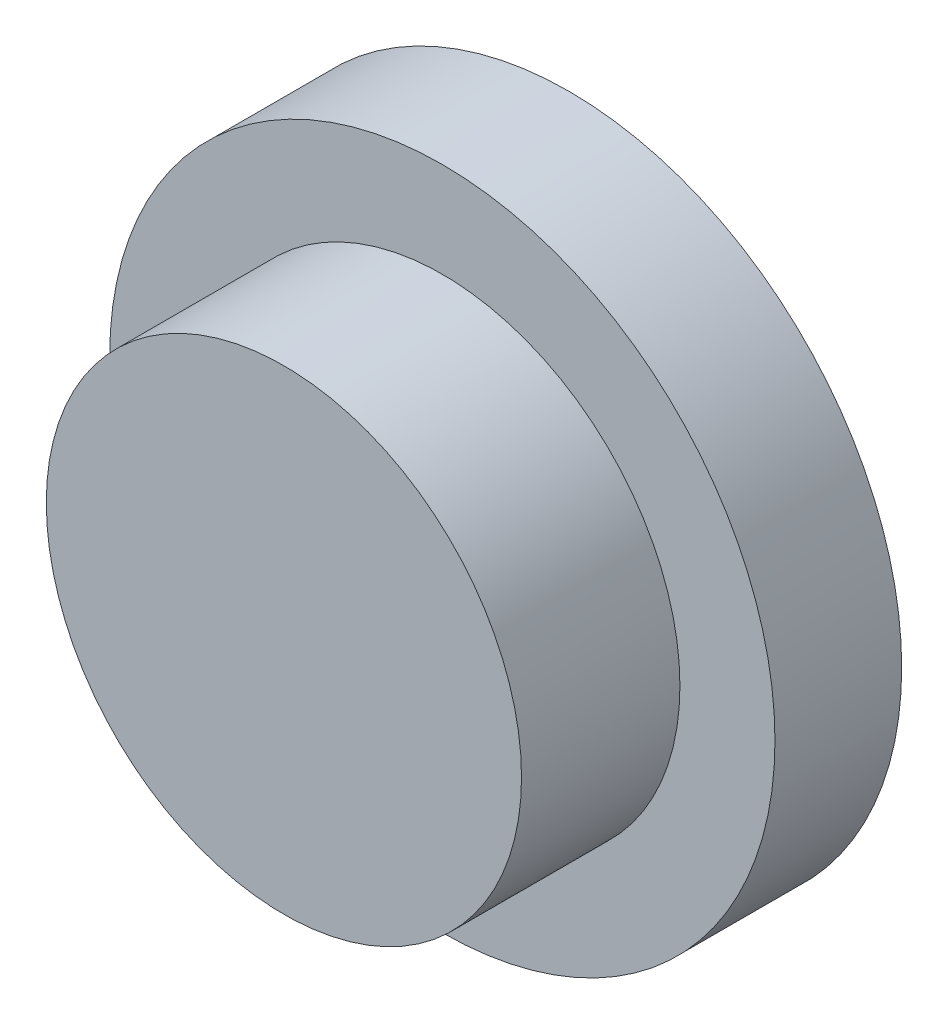
ISO-10303-21;
HEADER;
FILE_DESCRIPTION(('STEP AP214'),'2;1');
FILE_NAME('part.step','',(''),(''),'','','');
FILE_SCHEMA(('AUTOMOTIVE_DESIGN { 1 0 10303 214 1 1 1 1 }'));
ENDSEC;
DATA;
#1=APPLICATION_CONTEXT('core data for automotive mechanical design processes');
#2=APPLICATION_PROTOCOL_DEFINITION('international standard','automotive_design',2000,#1);
#3=PRODUCT_CONTEXT('',#1,'mechanical');
#4=PRODUCT('Part','Part','',(#3));
#5=PRODUCT_RELATED_PRODUCT_CATEGORY('part','',(#4));
#6=PRODUCT_DEFINITION_FORMATION('','',#4);
#7=PRODUCT_DEFINITION_CONTEXT('part definition',#1,'design');
#8=PRODUCT_DEFINITION('design','',#6,#7);
#9=PRODUCT_DEFINITION_SHAPE('','',#8);
#10=(LENGTH_UNIT() NAMED_UNIT(*) SI_UNIT(.MILLI.,.METRE.));
#11=(NAMED_UNIT(*) PLANE_ANGLE_UNIT() SI_UNIT($,.RADIAN.));
#12=(NAMED_UNIT(*) SI_UNIT($,.STERADIAN.) SOLID_ANGLE_UNIT());
#13=UNCERTAINTY_MEASURE_WITH_UNIT(LENGTH_MEASURE(1.E-05),#10,'distance_accuracy_value','');
#14=(GEOMETRIC_REPRESENTATION_CONTEXT(3) GLOBAL_UNCERTAINTY_ASSIGNED_CONTEXT((#13)) GLOBAL_UNIT_ASSIGNED_CONTEXT((#10,
#11,#12)) REPRESENTATION_CONTEXT('',''));
#15=CARTESIAN_POINT('',(0.,0.,0.));
#16=DIRECTION('',(0.,0.,1.));
#17=DIRECTION('',(1.,0.,0.));
#18=AXIS2_PLACEMENT_3D('',#15,#16,#17);
#19=CARTESIAN_POINT('',(0.,0.,5.));
#20=DIRECTION('',(0.,0.,-1.));
#21=DIRECTION('',(-1.,0.,0.));
#22=AXIS2_PLACEMENT_3D('',#19,#20,#21);
#23=CYLINDRICAL_SURFACE('',#22,7.5);
#24=CARTESIAN_POINT('',(0.,0.,5.));
#25=DIRECTION('',(0.,0.,1.));
#26=DIRECTION('',(1.,0.,0.));
#27=AXIS2_PLACEMENT_3D('',#24,#25,#26);
#28=CIRCLE('',#27,7.5);
#29=CARTESIAN_POINT('',(7.5,0.,5.));
#30=VERTEX_POINT('',#29);
#31=EDGE_CURVE('E53',#30,#30,#28,.T.);
#32=ORIENTED_EDGE('',*,*,#31,.F.);
#33=EDGE_LOOP('',(#32));
#34=FACE_BOUND('',#33,.T.);
#35=CARTESIAN_POINT('',(0.,0.,0.));
#36=DIRECTION('',(0.,0.,1.));
#37=DIRECTION('',(1.,0.,0.));
#38=AXIS2_PLACEMENT_3D('',#35,#36,#37);
#39=CIRCLE('',#38,7.5);
#40=CARTESIAN_POINT('',(7.5,0.,0.));
#41=VERTEX_POINT('',#40);
#42=EDGE_CURVE('E58',#41,#41,#39,.T.);
#43=ORIENTED_EDGE('',*,*,#42,.T.);
#44=EDGE_LOOP('',(#43));
#45=FACE_BOUND('',#44,.T.);
#46=ADVANCED_FACE('F39',(#34,#45),#23,.T.);
#47=CARTESIAN_POINT('',(0.,0.,5.));
#48=DIRECTION('',(0.,0.,1.));
#49=DIRECTION('',(1.,0.,0.));
#50=AXIS2_PLACEMENT_3D('',#47,#48,#49);
#51=PLANE('',#50);
#52=ORIENTED_EDGE('',*,*,#31,.T.);
#53=EDGE_LOOP('',(#52));
#54=FACE_BOUND('',#53,.T.);
#55=ADVANCED_FACE('F93',(#54),#51,.T.);
#56=CARTESIAN_POINT('',(0.,0.,-4.));
#57=DIRECTION('',(0.,0.,1.));
#58=DIRECTION('',(1.,0.,0.));
#59=AXIS2_PLACEMENT_3D('',#56,#57,#58);
#60=CYLINDRICAL_SURFACE('',#59,10.5);
#61=CARTESIAN_POINT('',(0.,0.,-4.));
#62=DIRECTION('',(0.,0.,-1.));
#63=DIRECTION('',(-1.,0.,0.));
#64=AXIS2_PLACEMENT_3D('',#61,#62,#63);
#65=CIRCLE('',#64,10.5);
#66=CARTESIAN_POINT('',(-10.5,0.,-4.));
#67=VERTEX_POINT('',#66);
#68=EDGE_CURVE('E63',#67,#67,#65,.T.);
#69=ORIENTED_EDGE('',*,*,#68,.F.);
#70=EDGE_LOOP('',(#69));
#71=FACE_BOUND('',#70,.T.);
#72=CARTESIAN_POINT('',(0.,0.,0.));
#73=DIRECTION('',(0.,0.,-1.));
#74=DIRECTION('',(-1.,0.,0.));
#75=AXIS2_PLACEMENT_3D('',#72,#73,#74);
#76=CIRCLE('',#75,10.5);
#77=CARTESIAN_POINT('',(-10.5,0.,0.));
#78=VERTEX_POINT('',#77);
#79=EDGE_CURVE('E65',#78,#78,#76,.T.);
#80=ORIENTED_EDGE('',*,*,#79,.T.);
#81=EDGE_LOOP('',(#80));
#82=FACE_BOUND('',#81,.T.);
#83=ADVANCED_FACE('F98',(#71,#82),#60,.T.);
#84=CARTESIAN_POINT('',(0.,0.,-4.));
#85=DIRECTION('',(0.,0.,-1.));
#86=DIRECTION('',(-1.,0.,0.));
#87=AXIS2_PLACEMENT_3D('',#84,#85,#86);
#88=PLANE('',#87);
#89=CARTESIAN_POINT('',(0.,0.,-4.));
#90=DIRECTION('',(0.,0.,-1.));
#91=DIRECTION('',(-1.,0.,0.));
#92=AXIS2_PLACEMENT_3D('',#89,#90,#91);
#93=CIRCLE('',#92,8.75);
#94=CARTESIAN_POINT('',(-8.75,0.,-4.));
#95=VERTEX_POINT('',#94);
#96=EDGE_CURVE('E10',#95,#95,#93,.F.);
#97=ORIENTED_EDGE('',*,*,#96,.T.);
#98=EDGE_LOOP('',(#97));
#99=FACE_BOUND('',#98,.T.);
#100=ORIENTED_EDGE('',*,*,#68,.T.);
#101=EDGE_LOOP('',(#100));
#102=FACE_BOUND('',#101,.T.);
#103=ADVANCED_FACE('F88',(#99,#102),#88,.T.);
#104=CARTESIAN_POINT('',(0.,0.,0.));
#105=DIRECTION('',(0.,0.,-1.));
#106=DIRECTION('',(-1.,0.,0.));
#107=AXIS2_PLACEMENT_3D('',#104,#105,#106);
#108=PLANE('',#107);
#109=ORIENTED_EDGE('',*,*,#42,.F.);
#110=EDGE_LOOP('',(#109));
#111=FACE_BOUND('',#110,.T.);
#112=ORIENTED_EDGE('',*,*,#79,.F.);
#113=EDGE_LOOP('',(#112));
#114=FACE_BOUND('',#113,.T.);
#115=ADVANCED_FACE('F81',(#111,#114),#108,.F.);
#116=CARTESIAN_POINT('',(0.,0.,-1.));
#117=DIRECTION('',(0.,0.,-1.));
#118=DIRECTION('',(-1.,0.,0.));
#119=AXIS2_PLACEMENT_3D('',#116,#117,#118);
#120=CYLINDRICAL_SURFACE('',#119,8.25);
#121=CARTESIAN_POINT('',(0.,0.,-3.5));
#122=DIRECTION('',(0.,0.,-1.));
#123=DIRECTION('',(-1.,0.,0.));
#124=AXIS2_PLACEMENT_3D('',#121,#122,#123);
#125=CIRCLE('',#124,8.25);
#126=CARTESIAN_POINT('',(-8.25,0.,-3.5));
#127=VERTEX_POINT('',#126);
#128=EDGE_CURVE('E48',#127,#127,#125,.T.);
#129=ORIENTED_EDGE('',*,*,#128,.T.);
#130=EDGE_LOOP('',(#129));
#131=FACE_BOUND('',#130,.T.);
#132=CARTESIAN_POINT('',(0.,0.,-1.));
#133=DIRECTION('',(0.,0.,-1.));
#134=DIRECTION('',(-1.,0.,0.));
#135=AXIS2_PLACEMENT_3D('',#132,#133,#134);
#136=CIRCLE('',#135,8.25);
#137=CARTESIAN_POINT('',(-8.25,0.,-1.));
#138=VERTEX_POINT('',#137);
#139=EDGE_CURVE('E69',#138,#138,#136,.T.);
#140=ORIENTED_EDGE('',*,*,#139,.F.);
#141=EDGE_LOOP('',(#140));
#142=FACE_BOUND('',#141,.T.);
#143=ADVANCED_FACE('F79',(#131,#142),#120,.F.);
#144=CARTESIAN_POINT('',(0.,0.,-1.));
#145=DIRECTION('',(0.,0.,-1.));
#146=DIRECTION('',(-1.,0.,0.));
#147=AXIS2_PLACEMENT_3D('',#144,#145,#146);
#148=PLANE('',#147);
#149=ORIENTED_EDGE('',*,*,#139,.T.);
#150=EDGE_LOOP('',(#149));
#151=FACE_BOUND('',#150,.T.);
#152=ADVANCED_FACE('F77',(#151),#148,.T.);
#153=CARTESIAN_POINT('',(0.,0.,-3.5));
#154=DIRECTION('',(0.,0.,-1.));
#155=DIRECTION('',(-1.,0.,0.));
#156=AXIS2_PLACEMENT_3D('',#153,#154,#155);
#157=CONICAL_SURFACE('',#156,8.25,0.785398163397452);
#158=ORIENTED_EDGE('',*,*,#96,.F.);
#159=EDGE_LOOP('',(#158));
#160=FACE_BOUND('',#159,.T.);
#161=ORIENTED_EDGE('',*,*,#128,.F.);
#162=EDGE_LOOP('',(#161));
#163=FACE_BOUND('',#162,.T.);
#164=ADVANCED_FACE('F42',(#160,#163),#157,.F.);
#165=CLOSED_SHELL('',(#46,#55,#83,#103,#115,#143,#152,#164));
#166=MANIFOLD_SOLID_BREP('B2',#165);
#167=ADVANCED_BREP_SHAPE_REPRESENTATION('',(#18,#166),#14);
#168=SHAPE_DEFINITION_REPRESENTATION(#9,#167);
ENDSEC;
END-ISO-10303-21;
